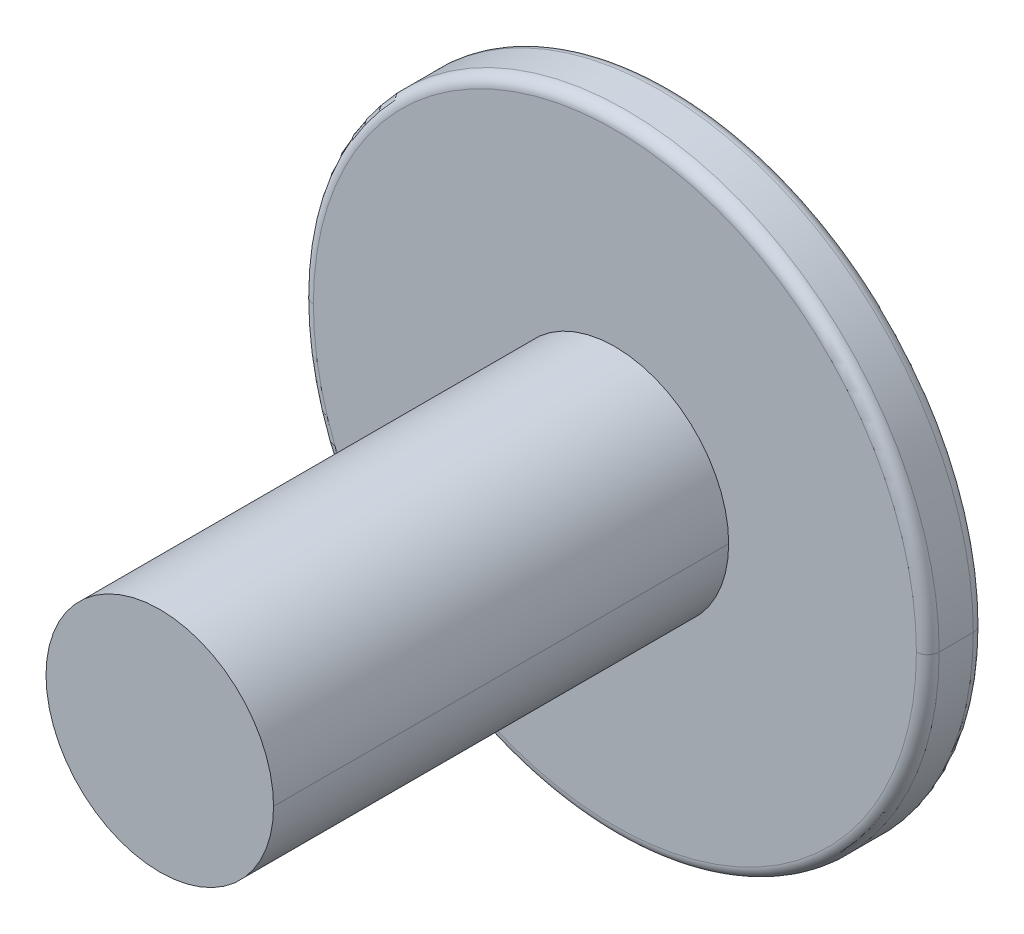
ISO-10303-21;
HEADER;
FILE_DESCRIPTION(('STEP AP214'),'2;1');
FILE_NAME('part.step','',(''),(''),'','','');
FILE_SCHEMA(('AUTOMOTIVE_DESIGN { 1 0 10303 214 1 1 1 1 }'));
ENDSEC;
DATA;
#1=APPLICATION_CONTEXT('core data for automotive mechanical design processes');
#2=APPLICATION_PROTOCOL_DEFINITION('international standard','automotive_design',2000,#1);
#3=PRODUCT_CONTEXT('',#1,'mechanical');
#4=PRODUCT('Part','Part','',(#3));
#5=PRODUCT_RELATED_PRODUCT_CATEGORY('part','',(#4));
#6=PRODUCT_DEFINITION_FORMATION('','',#4);
#7=PRODUCT_DEFINITION_CONTEXT('part definition',#1,'design');
#8=PRODUCT_DEFINITION('design','',#6,#7);
#9=PRODUCT_DEFINITION_SHAPE('','',#8);
#10=(LENGTH_UNIT() NAMED_UNIT(*) SI_UNIT(.MILLI.,.METRE.));
#11=(NAMED_UNIT(*) PLANE_ANGLE_UNIT() SI_UNIT($,.RADIAN.));
#12=(NAMED_UNIT(*) SI_UNIT($,.STERADIAN.) SOLID_ANGLE_UNIT());
#13=UNCERTAINTY_MEASURE_WITH_UNIT(LENGTH_MEASURE(1.E-05),#10,'distance_accuracy_value','');
#14=(GEOMETRIC_REPRESENTATION_CONTEXT(3) GLOBAL_UNCERTAINTY_ASSIGNED_CONTEXT((#13)) GLOBAL_UNIT_ASSIGNED_CONTEXT((#10,
#11,#12)) REPRESENTATION_CONTEXT('',''));
#15=CARTESIAN_POINT('',(0.,0.,0.));
#16=DIRECTION('',(0.,0.,1.));
#17=DIRECTION('',(1.,0.,0.));
#18=AXIS2_PLACEMENT_3D('',#15,#16,#17);
#19=CARTESIAN_POINT('',(0.,0.,4.5));
#20=DIRECTION('',(0.,0.,1.));
#21=DIRECTION('',(1.,0.,0.));
#22=AXIS2_PLACEMENT_3D('',#19,#20,#21);
#23=PLANE('',#22);
#24=CARTESIAN_POINT('',(0.,0.,4.5));
#25=DIRECTION('',(0.,0.,-1.));
#26=DIRECTION('',(-1.,0.,0.));
#27=AXIS2_PLACEMENT_3D('',#24,#25,#26);
#28=CIRCLE('',#27,1.);
#29=CARTESIAN_POINT('',(-1.,0.,4.5));
#30=VERTEX_POINT('',#29);
#31=CARTESIAN_POINT('',(1.,0.,4.5));
#32=VERTEX_POINT('',#31);
#33=EDGE_CURVE('E11',#30,#32,#28,.T.);
#34=ORIENTED_EDGE('',*,*,#33,.F.);
#35=CARTESIAN_POINT('',(0.,0.,4.5));
#36=DIRECTION('',(0.,0.,-1.));
#37=DIRECTION('',(1.,0.,0.));
#38=AXIS2_PLACEMENT_3D('',#35,#36,#37);
#39=CIRCLE('',#38,1.);
#40=EDGE_CURVE('E454',#32,#30,#39,.T.);
#41=ORIENTED_EDGE('',*,*,#40,.F.);
#42=EDGE_LOOP('',(#34,#41));
#43=FACE_BOUND('',#42,.T.);
#44=ADVANCED_FACE('F16',(#43),#23,.T.);
#45=CARTESIAN_POINT('',(0.,0.,4.5));
#46=DIRECTION('',(0.,0.,-1.));
#47=DIRECTION('',(-1.,0.,0.));
#48=AXIS2_PLACEMENT_3D('',#45,#46,#47);
#49=CYLINDRICAL_SURFACE('',#48,1.);
#50=DIRECTION('',(0.,0.,-1.));
#51=VECTOR('',#50,1.);
#52=CARTESIAN_POINT('',(1.,0.,4.5));
#53=LINE('',#52,#51);
#54=CARTESIAN_POINT('',(1.,0.,0.5));
#55=VERTEX_POINT('',#54);
#56=EDGE_CURVE('E29',#32,#55,#53,.T.);
#57=ORIENTED_EDGE('',*,*,#56,.T.);
#58=CARTESIAN_POINT('',(0.,0.,0.5));
#59=DIRECTION('',(0.,0.,1.));
#60=DIRECTION('',(1.,0.,0.));
#61=AXIS2_PLACEMENT_3D('',#58,#59,#60);
#62=CIRCLE('',#61,1.);
#63=CARTESIAN_POINT('',(-1.,0.,0.5));
#64=VERTEX_POINT('',#63);
#65=EDGE_CURVE('E515',#55,#64,#62,.T.);
#66=ORIENTED_EDGE('',*,*,#65,.T.);
#67=DIRECTION('',(0.,0.,-1.));
#68=VECTOR('',#67,1.);
#69=CARTESIAN_POINT('',(-1.,0.,4.5));
#70=LINE('',#69,#68);
#71=EDGE_CURVE('E520',#30,#64,#70,.T.);
#72=ORIENTED_EDGE('',*,*,#71,.F.);
#73=ORIENTED_EDGE('',*,*,#33,.T.);
#74=EDGE_LOOP('',(#57,#66,#72,#73));
#75=FACE_BOUND('',#74,.T.);
#76=ADVANCED_FACE('F378',(#75),#49,.T.);
#77=CARTESIAN_POINT('',(0.,0.,4.5));
#78=DIRECTION('',(0.,0.,-1.));
#79=DIRECTION('',(-1.,0.,0.));
#80=AXIS2_PLACEMENT_3D('',#77,#78,#79);
#81=CYLINDRICAL_SURFACE('',#80,1.);
#82=ORIENTED_EDGE('',*,*,#40,.T.);
#83=ORIENTED_EDGE('',*,*,#71,.T.);
#84=CARTESIAN_POINT('',(0.,0.,0.5));
#85=DIRECTION('',(0.,0.,1.));
#86=DIRECTION('',(-1.,0.,0.));
#87=AXIS2_PLACEMENT_3D('',#84,#85,#86);
#88=CIRCLE('',#87,1.);
#89=EDGE_CURVE('E519',#64,#55,#88,.T.);
#90=ORIENTED_EDGE('',*,*,#89,.T.);
#91=ORIENTED_EDGE('',*,*,#56,.F.);
#92=EDGE_LOOP('',(#82,#83,#90,#91));
#93=FACE_BOUND('',#92,.T.);
#94=ADVANCED_FACE('F748',(#93),#81,.T.);
#95=CARTESIAN_POINT('',(0.,0.,0.4));
#96=DIRECTION('',(0.,0.,1.));
#97=DIRECTION('',(1.,0.,0.));
#98=AXIS2_PLACEMENT_3D('',#95,#96,#97);
#99=TOROIDAL_SURFACE('',#98,2.65,0.1);
#100=CARTESIAN_POINT('',(0.,0.,0.4));
#101=DIRECTION('',(0.,0.,-1.));
#102=DIRECTION('',(1.,0.,0.));
#103=AXIS2_PLACEMENT_3D('',#100,#101,#102);
#104=CIRCLE('',#103,2.75);
#105=CARTESIAN_POINT('',(2.75,0.,0.4));
#106=VERTEX_POINT('',#105);
#107=CARTESIAN_POINT('',(-2.75,0.,0.4));
#108=VERTEX_POINT('',#107);
#109=EDGE_CURVE('E1241',#106,#108,#104,.T.);
#110=ORIENTED_EDGE('',*,*,#109,.F.);
#111=CARTESIAN_POINT('',(2.65,0.,0.4));
#112=DIRECTION('',(0.,-1.,0.));
#113=DIRECTION('',(1.,0.,0.));
#114=AXIS2_PLACEMENT_3D('',#111,#112,#113);
#115=CIRCLE('',#114,0.1);
#116=CARTESIAN_POINT('',(2.65,0.,0.5));
#117=VERTEX_POINT('',#116);
#118=EDGE_CURVE('E469',#106,#117,#115,.T.);
#119=ORIENTED_EDGE('',*,*,#118,.T.);
#120=CARTESIAN_POINT('',(0.,0.,0.5));
#121=DIRECTION('',(0.,0.,-1.));
#122=DIRECTION('',(1.,0.,0.));
#123=AXIS2_PLACEMENT_3D('',#120,#121,#122);
#124=CIRCLE('',#123,2.65);
#125=CARTESIAN_POINT('',(-2.65,0.,0.5));
#126=VERTEX_POINT('',#125);
#127=EDGE_CURVE('E470',#117,#126,#124,.T.);
#128=ORIENTED_EDGE('',*,*,#127,.T.);
#129=CARTESIAN_POINT('',(-2.65,0.,0.4));
#130=DIRECTION('',(0.,1.,0.));
#131=DIRECTION('',(-1.,0.,0.));
#132=AXIS2_PLACEMENT_3D('',#129,#130,#131);
#133=CIRCLE('',#132,0.1);
#134=EDGE_CURVE('E529',#108,#126,#133,.T.);
#135=ORIENTED_EDGE('',*,*,#134,.F.);
#136=EDGE_LOOP('',(#110,#119,#128,#135));
#137=FACE_BOUND('',#136,.T.);
#138=ADVANCED_FACE('F743',(#137),#99,.T.);
#139=CARTESIAN_POINT('',(1.025578394524,-0.1931740126673,-1.));
#140=DIRECTION('',(0.,-0.981627183447674,0.190808995376495));
#141=DIRECTION('',(-1.,0.,0.));
#142=AXIS2_PLACEMENT_3D('',#139,#140,#141);
#143=PLANE('',#142);
#144=DIRECTION('',(-1.,-9.308210153282E-09,0.));
#145=VECTOR('',#144,1.);
#146=CARTESIAN_POINT('',(0.8790232051424,-0.1931740062833,-1.));
#147=LINE('',#146,#145);
#148=CARTESIAN_POINT('',(0.8790232051424,-0.1931740062833,-1.));
#149=VERTEX_POINT('',#148);
#150=CARTESIAN_POINT('',(0.1931740126673,-0.1931740126673,-1.));
#151=VERTEX_POINT('',#150);
#152=EDGE_CURVE('E450',#149,#151,#147,.T.);
#153=ORIENTED_EDGE('',*,*,#152,.T.);
#154=DIRECTION('',(0.187427559991904,-0.187427559991904,-0.964231206459821));
#155=VECTOR('',#154,1.);
#156=CARTESIAN_POINT('',(0.,0.,-0.006205857351492));
#157=LINE('',#156,#155);
#158=CARTESIAN_POINT('',(0.,0.,-0.006205857351492));
#159=VERTEX_POINT('',#158);
#160=EDGE_CURVE('E288',#159,#151,#157,.T.);
#161=ORIENTED_EDGE('',*,*,#160,.F.);
#162=DIRECTION('',(-1.,0.,0.));
#163=VECTOR('',#162,1.);
#164=CARTESIAN_POINT('',(0.8324043818572,0.,-0.006205857351446));
#165=LINE('',#164,#163);
#166=CARTESIAN_POINT('',(0.8324043818572,0.,-0.006205857351446));
#167=VERTEX_POINT('',#166);
#168=EDGE_CURVE('E484',#167,#159,#165,.T.);
#169=ORIENTED_EDGE('',*,*,#168,.F.);
#170=DIRECTION('',(0.187427560074405,-0.187427558764205,-0.964231206682425));
#171=VECTOR('',#170,1.);
#172=CARTESIAN_POINT('',(0.8324043818572,0.,-0.006205857351446));
#173=LINE('',#172,#171);
#174=CARTESIAN_POINT('',(1.023151677917,-0.1907472947266,-0.9875156251272));
#175=VERTEX_POINT('',#174);
#176=EDGE_CURVE('E184',#167,#175,#173,.T.);
#177=ORIENTED_EDGE('',*,*,#176,.T.);
#178=CARTESIAN_POINT('',(1.023151677917,-0.1907472947266,-0.9875156251272));
#179=CARTESIAN_POINT('',(1.007274944629,-0.1912862098716,-0.9902881032007));
#180=CARTESIAN_POINT('',(0.9754280751451,-0.1921838571073,-0.9949060925108));
#181=CARTESIAN_POINT('',(0.9272803540647,-0.1929941013938,-0.9990744222959));
#182=CARTESIAN_POINT('',(0.8951301687386,-0.1931740062833,-1.));
#183=CARTESIAN_POINT('',(0.8790232051424,-0.1931740062833,-1.));
#184=(BOUNDED_CURVE() B_SPLINE_CURVE(3,(#178,#179,#180,#181,#182,#183),.UNSPECIFIED.,.F.,
.F.) B_SPLINE_CURVE_WITH_KNOTS((4,1,1,4),(0.,0.3333333333333,0.6666666666667,1.),
.UNSPECIFIED.) CURVE() GEOMETRIC_REPRESENTATION_ITEM() RATIONAL_B_SPLINE_CURVE((1.,1.,1.,1.,1.,1.)) REPRESENTATION_ITEM(''));
#185=EDGE_CURVE('E179',#175,#149,#184,.T.);
#186=ORIENTED_EDGE('',*,*,#185,.T.);
#187=EDGE_LOOP('',(#153,#161,#169,#177,#186));
#188=FACE_BOUND('',#187,.T.);
#189=ADVANCED_FACE('F571',(#188),#143,.F.);
#190=CARTESIAN_POINT('',(0.,0.,-1.));
#191=DIRECTION('',(0.,0.,-1.));
#192=DIRECTION('',(0.,-1.,0.));
#193=AXIS2_PLACEMENT_3D('',#190,#191,#192);
#194=PLANE('',#193);
#195=ORIENTED_EDGE('',*,*,#152,.F.);
#196=CARTESIAN_POINT('',(0.,0.,-1.));
#197=DIRECTION('',(0.,0.,1.));
#198=DIRECTION('',(0.214637791852591,-0.976693717758358,0.));
#199=AXIS2_PLACEMENT_3D('',#196,#197,#198);
#200=CIRCLE('',#199,0.9);
#201=CARTESIAN_POINT('',(0.1931740126673,-0.8790243459825,-1.));
#202=VERTEX_POINT('',#201);
#203=EDGE_CURVE('E225',#202,#149,#200,.T.);
#204=ORIENTED_EDGE('',*,*,#203,.F.);
#205=DIRECTION('',(2.35711230862E-09,-1.,0.));
#206=VECTOR('',#205,1.);
#207=CARTESIAN_POINT('',(0.1931740126673,-0.1931740126673,-1.));
#208=LINE('',#207,#206);
#209=EDGE_CURVE('E455',#151,#202,#208,.T.);
#210=ORIENTED_EDGE('',*,*,#209,.F.);
#211=EDGE_LOOP('',(#195,#204,#210));
#212=FACE_BOUND('',#211,.T.);
#213=ADVANCED_FACE('F266',(#212),#194,.T.);
#214=CARTESIAN_POINT('',(0.1931740126673,-0.1931740126673,-1.));
#215=DIRECTION('',(0.981627183447674,0.,0.190808995376495));
#216=DIRECTION('',(0.,-1.,0.));
#217=AXIS2_PLACEMENT_3D('',#214,#215,#216);
#218=PLANE('',#217);
#219=DIRECTION('',(0.187427564971895,-0.187427559504395,-0.964231205586571));
#220=VECTOR('',#219,1.);
#221=CARTESIAN_POINT('',(0.,-0.8324043818572,-0.006205857351446));
#222=LINE('',#221,#220);
#223=CARTESIAN_POINT('',(0.,-0.8324043818572,-0.006205857351446));
#224=VERTEX_POINT('',#223);
#225=CARTESIAN_POINT('',(0.1907473090267,-1.02315168532,-0.987515665078));
#226=VERTEX_POINT('',#225);
#227=EDGE_CURVE('E280',#224,#226,#222,.T.);
#228=ORIENTED_EDGE('',*,*,#227,.F.);
#229=DIRECTION('',(0.,1.,0.));
#230=VECTOR('',#229,1.);
#231=CARTESIAN_POINT('',(0.,-0.8324043818572,-0.006205857351446));
#232=LINE('',#231,#230);
#233=EDGE_CURVE('E305',#224,#159,#232,.T.);
#234=ORIENTED_EDGE('',*,*,#233,.T.);
#235=ORIENTED_EDGE('',*,*,#160,.T.);
#236=ORIENTED_EDGE('',*,*,#209,.T.);
#237=CARTESIAN_POINT('',(0.1931740142839,-0.8790246348509,-1.));
#238=CARTESIAN_POINT('',(0.1931740142839,-0.895129465077,-1.));
#239=CARTESIAN_POINT('',(0.1929940981981,-0.927280722173,-0.9990744205812));
#240=CARTESIAN_POINT('',(0.1921838496556,-0.9754280174418,-0.9949060643752));
#241=CARTESIAN_POINT('',(0.1912862235996,-1.007274969102,-0.990288140208));
#242=CARTESIAN_POINT('',(0.1907473090267,-1.02315168532,-0.987515665078));
#243=(BOUNDED_CURVE() B_SPLINE_CURVE(3,(#237,#238,#239,#240,#241,#242),.UNSPECIFIED.,.F.,
.F.) B_SPLINE_CURVE_WITH_KNOTS((4,1,1,4),(0.,0.3333333333333,0.6666666666667,1.),
.UNSPECIFIED.) CURVE() GEOMETRIC_REPRESENTATION_ITEM() RATIONAL_B_SPLINE_CURVE((1.,1.,1.,1.,1.,1.)) REPRESENTATION_ITEM(''));
#244=EDGE_CURVE('E292',#202,#226,#243,.T.);
#245=ORIENTED_EDGE('',*,*,#244,.T.);
#246=EDGE_LOOP('',(#228,#234,#235,#236,#245));
#247=FACE_BOUND('',#246,.T.);
#248=ADVANCED_FACE('F257',(#247),#218,.F.);
#249=CARTESIAN_POINT('',(0.1931740126673,-1.025578394524,-1.));
#250=DIRECTION('',(0.,-0.981627183447674,0.190808995376495));
#251=DIRECTION('',(-1.,0.,0.));
#252=AXIS2_PLACEMENT_3D('',#249,#250,#251);
#253=PLANE('',#252);
#254=DIRECTION('',(-0.187427558729307,-0.187427560115408,-0.964231206681238));
#255=VECTOR('',#254,1.);
#256=CARTESIAN_POINT('',(0.,-0.8324043818572,-0.006205857351446));
#257=LINE('',#256,#255);
#258=CARTESIAN_POINT('',(-0.1907472946485,-1.023151677916,-0.9875156249064));
#259=VERTEX_POINT('',#258);
#260=EDGE_CURVE('E289',#224,#259,#257,.T.);
#261=ORIENTED_EDGE('',*,*,#260,.F.);
#262=ORIENTED_EDGE('',*,*,#227,.T.);
#263=CARTESIAN_POINT('',(0.1907473090267,-1.02315168563074,-0.987515665017598));
#264=CARTESIAN_POINT('',(6.51179237024261E-07,-1.02432632330745,-0.993558651994614));
#265=CARTESIAN_POINT('',(-0.1907472946485,-1.0231516778369,-0.987515624921775));
#266=B_SPLINE_CURVE_WITH_KNOTS('',2,(#263,#264,#265),.UNSPECIFIED.,.F.,.F.,(3,3),(0.,1.),.UNSPECIFIED.);
#267=EDGE_CURVE('E239',#226,#259,#266,.T.);
#268=ORIENTED_EDGE('',*,*,#267,.T.);
#269=EDGE_LOOP('',(#261,#262,#268));
#270=FACE_BOUND('',#269,.T.);
#271=ADVANCED_FACE('F246',(#270),#253,.F.);
#272=CARTESIAN_POINT('',(-0.1931740126673,-0.1931740126673,-1.));
#273=DIRECTION('',(-0.981627183447674,0.,0.190808995376495));
#274=DIRECTION('',(0.,1.,0.));
#275=AXIS2_PLACEMENT_3D('',#272,#273,#274);
#276=PLANE('',#275);
#277=DIRECTION('',(-9.246083379796E-09,1.,0.));
#278=VECTOR('',#277,1.);
#279=CARTESIAN_POINT('',(-0.1931740063259,-0.8790232127573,-1.));
#280=LINE('',#279,#278);
#281=CARTESIAN_POINT('',(-0.1931740063259,-0.8790232127573,-1.));
#282=VERTEX_POINT('',#281);
#283=CARTESIAN_POINT('',(-0.1931740126673,-0.1931740126673,-1.));
#284=VERTEX_POINT('',#283);
#285=EDGE_CURVE('E448',#282,#284,#280,.T.);
#286=ORIENTED_EDGE('',*,*,#285,.T.);
#287=DIRECTION('',(-0.187427559991904,-0.187427559991904,-0.964231206459821));
#288=VECTOR('',#287,1.);
#289=CARTESIAN_POINT('',(0.,0.,-0.006205857351492));
#290=LINE('',#289,#288);
#291=EDGE_CURVE('E449',#159,#284,#290,.T.);
#292=ORIENTED_EDGE('',*,*,#291,.F.);
#293=ORIENTED_EDGE('',*,*,#233,.F.);
#294=ORIENTED_EDGE('',*,*,#260,.T.);
#295=CARTESIAN_POINT('',(-0.1907472946485,-1.023151677916,-0.9875156249064));
#296=CARTESIAN_POINT('',(-0.1912862097935,-1.007274944639,-0.9902881029801));
#297=CARTESIAN_POINT('',(-0.192183857146,-0.9754280746468,-0.9949060925964));
#298=CARTESIAN_POINT('',(-0.1929941013666,-0.9272803558642,-0.9990744222823));
#299=CARTESIAN_POINT('',(-0.1931740063259,-0.8951301649238,-1.));
#300=CARTESIAN_POINT('',(-0.1931740063259,-0.8790232127573,-1.));
#301=(BOUNDED_CURVE() B_SPLINE_CURVE(3,(#295,#296,#297,#298,#299,#300),.UNSPECIFIED.,.F.,
.F.) B_SPLINE_CURVE_WITH_KNOTS((4,1,1,4),(0.,0.3333333333333,0.6666666666667,1.),
.UNSPECIFIED.) CURVE() GEOMETRIC_REPRESENTATION_ITEM() RATIONAL_B_SPLINE_CURVE((1.,1.,1.,1.,1.,1.)) REPRESENTATION_ITEM(''));
#302=EDGE_CURVE('E308',#259,#282,#301,.T.);
#303=ORIENTED_EDGE('',*,*,#302,.T.);
#304=EDGE_LOOP('',(#286,#292,#293,#294,#303));
#305=FACE_BOUND('',#304,.T.);
#306=ADVANCED_FACE('F256',(#305),#276,.F.);
#307=CARTESIAN_POINT('',(0.,0.,-1.));
#308=DIRECTION('',(0.,0.,-1.));
#309=DIRECTION('',(0.,-1.,0.));
#310=AXIS2_PLACEMENT_3D('',#307,#308,#309);
#311=PLANE('',#310);
#312=CARTESIAN_POINT('',(0.,0.,-1.));
#313=DIRECTION('',(0.,0.,1.));
#314=DIRECTION('',(-0.976693717758358,-0.214637791852591,0.));
#315=AXIS2_PLACEMENT_3D('',#312,#313,#314);
#316=CIRCLE('',#315,0.9);
#317=CARTESIAN_POINT('',(-0.8790243459825,-0.1931740126673,-1.));
#318=VERTEX_POINT('',#317);
#319=EDGE_CURVE('E312',#318,#282,#316,.T.);
#320=ORIENTED_EDGE('',*,*,#319,.F.);
#321=DIRECTION('',(-1.,-2.356972205573E-09,0.));
#322=VECTOR('',#321,1.);
#323=CARTESIAN_POINT('',(-0.1931740126673,-0.1931740126673,-1.));
#324=LINE('',#323,#322);
#325=EDGE_CURVE('E445',#284,#318,#324,.T.);
#326=ORIENTED_EDGE('',*,*,#325,.F.);
#327=ORIENTED_EDGE('',*,*,#285,.F.);
#328=EDGE_LOOP('',(#320,#326,#327));
#329=FACE_BOUND('',#328,.T.);
#330=ADVANCED_FACE('F668',(#329),#311,.T.);
#331=CARTESIAN_POINT('',(-0.1931740126673,-0.1931740126673,-1.));
#332=DIRECTION('',(0.,-0.981627183447674,0.190808995376495));
#333=DIRECTION('',(-1.,0.,0.));
#334=AXIS2_PLACEMENT_3D('',#331,#332,#333);
#335=PLANE('',#334);
#336=DIRECTION('',(-0.187427559657298,-0.187427564965499,-0.964231205558093));
#337=VECTOR('',#336,1.);
#338=CARTESIAN_POINT('',(-0.8324043818572,0.,-0.006205857351446));
#339=LINE('',#338,#337);
#340=CARTESIAN_POINT('',(-0.8324043818572,0.,-0.006205857351446));
#341=VERTEX_POINT('',#340);
#342=CARTESIAN_POINT('',(-1.023151685475,-0.1907473090205,-0.9875156650503));
#343=VERTEX_POINT('',#342);
#344=EDGE_CURVE('E512',#341,#343,#339,.T.);
#345=ORIENTED_EDGE('',*,*,#344,.F.);
#346=DIRECTION('',(1.,0.,0.));
#347=VECTOR('',#346,1.);
#348=CARTESIAN_POINT('',(-0.8324043818572,0.,-0.006205857351446));
#349=LINE('',#348,#347);
#350=EDGE_CURVE('E490',#341,#159,#349,.T.);
#351=ORIENTED_EDGE('',*,*,#350,.T.);
#352=ORIENTED_EDGE('',*,*,#291,.T.);
#353=ORIENTED_EDGE('',*,*,#325,.T.);
#354=CARTESIAN_POINT('',(-0.8790246348337,-0.1931740142838,-1.));
#355=CARTESIAN_POINT('',(-0.8951294650856,-0.1931740142838,-1.));
#356=CARTESIAN_POINT('',(-0.92728072219,-0.1929940981975,-0.9990744205787));
#357=CARTESIAN_POINT('',(-0.9754280173694,-0.1921838496577,-0.9949060643838));
#358=CARTESIAN_POINT('',(-1.007274969259,-0.191286223595,-0.9902881401893));
#359=CARTESIAN_POINT('',(-1.023151685475,-0.1907473090205,-0.9875156650503));
#360=(BOUNDED_CURVE() B_SPLINE_CURVE(3,(#354,#355,#356,#357,#358,#359),.UNSPECIFIED.,.F.,
.F.) B_SPLINE_CURVE_WITH_KNOTS((4,1,1,4),(0.,0.3333333333333,0.6666666666667,1.),
.UNSPECIFIED.) CURVE() GEOMETRIC_REPRESENTATION_ITEM() RATIONAL_B_SPLINE_CURVE((1.,1.,1.,1.,1.,1.)) REPRESENTATION_ITEM(''));
#361=EDGE_CURVE('E478',#318,#343,#360,.T.);
#362=ORIENTED_EDGE('',*,*,#361,.T.);
#363=EDGE_LOOP('',(#345,#351,#352,#353,#362));
#364=FACE_BOUND('',#363,.T.);
#365=ADVANCED_FACE('F342',(#364),#335,.F.);
#366=CARTESIAN_POINT('',(-1.025578394524,0.1931740126673,-1.));
#367=DIRECTION('',(-0.981627183447674,0.,0.190808995376495));
#368=DIRECTION('',(0.,1.,0.));
#369=AXIS2_PLACEMENT_3D('',#366,#367,#368);
#370=PLANE('',#369);
#371=CARTESIAN_POINT('',(-1.02370793964649,0.,-0.990377343848199));
#372=DIRECTION('',(0.00291588331628573,0.999883228205621,0.0150009192249037));
#373=VECTOR('',#372,1.);
#374=LINE('',#371,#373);
#375=CARTESIAN_POINT('',(-1.023707939647,0.,-0.990377343848));
#376=VERTEX_POINT('',#375);
#377=CARTESIAN_POINT('',(-1.023151677877,0.1907472946499,-0.9875156249129));
#378=VERTEX_POINT('',#377);
#379=EDGE_CURVE('E361',#376,#378,#374,.T.);
#380=ORIENTED_EDGE('',*,*,#379,.T.);
#381=DIRECTION('',(-0.187427560076595,0.187427558730895,-0.964231206688474));
#382=VECTOR('',#381,1.);
#383=CARTESIAN_POINT('',(-0.8324043818572,0.,-0.006205857351446));
#384=LINE('',#383,#382);
#385=EDGE_CURVE('E366',#341,#378,#384,.T.);
#386=ORIENTED_EDGE('',*,*,#385,.F.);
#387=ORIENTED_EDGE('',*,*,#344,.T.);
#388=CARTESIAN_POINT('',(-1.0231516856312,-0.1907473090205,-0.987515665019938));
#389=DIRECTION('',(-0.00291584224803148,0.999883231495094,-0.0150007079470538));
#390=VECTOR('',#389,1.);
#391=LINE('',#388,#390);
#392=EDGE_CURVE('E325',#343,#376,#391,.T.);
#393=ORIENTED_EDGE('',*,*,#392,.T.);
#394=EDGE_LOOP('',(#380,#386,#387,#393));
#395=FACE_BOUND('',#394,.T.);
#396=ADVANCED_FACE('F331',(#395),#370,.F.);
#397=CARTESIAN_POINT('',(-0.1931740126673,0.1931740126673,-1.));
#398=DIRECTION('',(0.,0.981627183447674,0.190808995376495));
#399=DIRECTION('',(1.,0.,0.));
#400=AXIS2_PLACEMENT_3D('',#397,#398,#399);
#401=PLANE('',#400);
#402=DIRECTION('',(1.,9.24622008403E-09,0.));
#403=VECTOR('',#402,1.);
#404=CARTESIAN_POINT('',(-0.8790232127406,0.1931740063258,-1.));
#405=LINE('',#404,#403);
#406=CARTESIAN_POINT('',(-0.8790232127406,0.1931740063258,-1.));
#407=VERTEX_POINT('',#406);
#408=CARTESIAN_POINT('',(-0.1931740126673,0.1931740126673,-1.));
#409=VERTEX_POINT('',#408);
#410=EDGE_CURVE('E488',#407,#409,#405,.T.);
#411=ORIENTED_EDGE('',*,*,#410,.T.);
#412=DIRECTION('',(-0.187427559991904,0.187427559991904,-0.964231206459821));
#413=VECTOR('',#412,1.);
#414=CARTESIAN_POINT('',(0.,0.,-0.006205857351492));
#415=LINE('',#414,#413);
#416=EDGE_CURVE('E397',#159,#409,#415,.T.);
#417=ORIENTED_EDGE('',*,*,#416,.F.);
#418=ORIENTED_EDGE('',*,*,#350,.F.);
#419=ORIENTED_EDGE('',*,*,#385,.T.);
#420=CARTESIAN_POINT('',(-1.023151677877,0.1907472946499,-0.9875156249129));
#421=CARTESIAN_POINT('',(-1.007274944599,0.1912862097945,-0.9902881029842));
#422=CARTESIAN_POINT('',(-0.9754280746666,0.1921838571456,-0.9949060925944));
#423=CARTESIAN_POINT('',(-0.927280355855,0.1929941013667,-0.9990744222828));
#424=CARTESIAN_POINT('',(-0.8951301649322,0.1931740063258,-1.));
#425=CARTESIAN_POINT('',(-0.8790232127406,0.1931740063258,-1.));
#426=(BOUNDED_CURVE() B_SPLINE_CURVE(3,(#420,#421,#422,#423,#424,#425),.UNSPECIFIED.,.F.,
.F.) B_SPLINE_CURVE_WITH_KNOTS((4,1,1,4),(0.,0.3333333333333,0.6666666666667,1.),
.UNSPECIFIED.) CURVE() GEOMETRIC_REPRESENTATION_ITEM() RATIONAL_B_SPLINE_CURVE((1.,1.,1.,1.,1.,1.)) REPRESENTATION_ITEM(''));
#427=EDGE_CURVE('E630',#378,#407,#426,.T.);
#428=ORIENTED_EDGE('',*,*,#427,.T.);
#429=EDGE_LOOP('',(#411,#417,#418,#419,#428));
#430=FACE_BOUND('',#429,.T.);
#431=ADVANCED_FACE('F341',(#430),#401,.F.);
#432=CARTESIAN_POINT('',(0.,0.,-1.));
#433=DIRECTION('',(0.,0.,-1.));
#434=DIRECTION('',(0.,-1.,0.));
#435=AXIS2_PLACEMENT_3D('',#432,#433,#434);
#436=PLANE('',#435);
#437=ORIENTED_EDGE('',*,*,#410,.F.);
#438=CARTESIAN_POINT('',(0.,0.,-1.));
#439=DIRECTION('',(0.,0.,1.));
#440=DIRECTION('',(-0.214637791852591,0.976693717758358,0.));
#441=AXIS2_PLACEMENT_3D('',#438,#439,#440);
#442=CIRCLE('',#441,0.9);
#443=CARTESIAN_POINT('',(-0.1931740126673,0.8790243459825,-1.));
#444=VERTEX_POINT('',#443);
#445=EDGE_CURVE('E405',#444,#407,#442,.T.);
#446=ORIENTED_EDGE('',*,*,#445,.F.);
#447=DIRECTION('',(-2.294991660756E-09,1.,0.));
#448=VECTOR('',#447,1.);
#449=CARTESIAN_POINT('',(-0.1931740126673,0.1931740126673,-1.));
#450=LINE('',#449,#448);
#451=EDGE_CURVE('E491',#409,#444,#450,.T.);
#452=ORIENTED_EDGE('',*,*,#451,.F.);
#453=EDGE_LOOP('',(#437,#446,#452));
#454=FACE_BOUND('',#453,.T.);
#455=ADVANCED_FACE('F656',(#454),#436,.T.);
#456=CARTESIAN_POINT('',(-0.1931740126673,1.025578394524,-1.));
#457=DIRECTION('',(-0.981627183447674,0.,0.190808995376495));
#458=DIRECTION('',(0.,1.,0.));
#459=AXIS2_PLACEMENT_3D('',#456,#457,#458);
#460=PLANE('',#459);
#461=DIRECTION('',(-0.187427565005303,0.187427559501104,-0.964231205580717));
#462=VECTOR('',#461,1.);
#463=CARTESIAN_POINT('',(0.,0.8324043818572,-0.006205857351446));
#464=LINE('',#463,#462);
#465=CARTESIAN_POINT('',(0.,0.8324043818572,-0.006205857351446));
#466=VERTEX_POINT('',#465);
#467=CARTESIAN_POINT('',(-0.1907473091037,1.023151685359,-0.987515665293));
#468=VERTEX_POINT('',#467);
#469=EDGE_CURVE('E389',#466,#468,#464,.T.);
#470=ORIENTED_EDGE('',*,*,#469,.F.);
#471=DIRECTION('',(0.,-1.,0.));
#472=VECTOR('',#471,1.);
#473=CARTESIAN_POINT('',(0.,0.8324043818572,-0.006205857351446));
#474=LINE('',#473,#472);
#475=EDGE_CURVE('E416',#466,#159,#474,.T.);
#476=ORIENTED_EDGE('',*,*,#475,.T.);
#477=ORIENTED_EDGE('',*,*,#416,.T.);
#478=ORIENTED_EDGE('',*,*,#451,.T.);
#479=CARTESIAN_POINT('',(-0.1931740142413,0.879024627238,-1.));
#480=CARTESIAN_POINT('',(-0.1931740142413,0.8951294688908,-1.));
#481=CARTESIAN_POINT('',(-0.1929940982252,0.9272807203791,-0.9990744205944));
#482=CARTESIAN_POINT('',(-0.1921838496172,0.9754280179217,-0.9949060642913));
#483=CARTESIAN_POINT('',(-0.1912862236769,1.007274969131,-0.990288140425));
#484=CARTESIAN_POINT('',(-0.1907473091037,1.023151685359,-0.987515665293));
#485=(BOUNDED_CURVE() B_SPLINE_CURVE(3,(#479,#480,#481,#482,#483,#484),.UNSPECIFIED.,.F.,
.F.) B_SPLINE_CURVE_WITH_KNOTS((4,1,1,4),(0.,0.3333333333333,0.6666666666667,1.),
.UNSPECIFIED.) CURVE() GEOMETRIC_REPRESENTATION_ITEM() RATIONAL_B_SPLINE_CURVE((1.,1.,1.,1.,1.,1.)) REPRESENTATION_ITEM(''));
#486=EDGE_CURVE('E401',#444,#468,#485,.T.);
#487=ORIENTED_EDGE('',*,*,#486,.T.);
#488=EDGE_LOOP('',(#470,#476,#477,#478,#487));
#489=FACE_BOUND('',#488,.T.);
#490=ADVANCED_FACE('F867',(#489),#460,.F.);
#491=CARTESIAN_POINT('',(0.1931740126673,1.025578394524,-1.));
#492=DIRECTION('',(0.,0.981627183447674,0.190808995376495));
#493=DIRECTION('',(1.,0.,0.));
#494=AXIS2_PLACEMENT_3D('',#491,#492,#493);
#495=PLANE('',#494);
#496=DIRECTION('',(0.187427558762695,0.187427560112195,-0.964231206675373));
#497=VECTOR('',#496,1.);
#498=CARTESIAN_POINT('',(0.,0.8324043818572,-0.006205857351446));
#499=LINE('',#498,#497);
#500=CARTESIAN_POINT('',(0.1907472947253,1.023151677956,-0.987515625121));
#501=VERTEX_POINT('',#500);
#502=EDGE_CURVE('E398',#466,#501,#499,.T.);
#503=ORIENTED_EDGE('',*,*,#502,.F.);
#504=ORIENTED_EDGE('',*,*,#469,.T.);
#505=CARTESIAN_POINT('',(-0.1907473091037,1.02315168567243,-0.987515665232075));
#506=CARTESIAN_POINT('',(-6.51195779482854E-07,1.02432632335035,-0.993558652215319));
#507=CARTESIAN_POINT('',(0.1907472947253,1.02315167787856,-0.987515625136054));
#508=B_SPLINE_CURVE_WITH_KNOTS('',2,(#505,#506,#507),.UNSPECIFIED.,.F.,.F.,(3,3),(0.,1.),.UNSPECIFIED.);
#509=EDGE_CURVE('E406',#468,#501,#508,.T.);
#510=ORIENTED_EDGE('',*,*,#509,.T.);
#511=EDGE_LOOP('',(#503,#504,#510));
#512=FACE_BOUND('',#511,.T.);
#513=ADVANCED_FACE('F271',(#512),#495,.F.);
#514=CARTESIAN_POINT('',(0.1931740126673,1.025578394524,-1.));
#515=DIRECTION('',(0.981627183447674,0.,0.190808995376495));
#516=DIRECTION('',(0.,-1.,0.));
#517=AXIS2_PLACEMENT_3D('',#514,#515,#516);
#518=PLANE('',#517);
#519=DIRECTION('',(9.308071870755E-09,-1.,0.));
#520=VECTOR('',#519,1.);
#521=CARTESIAN_POINT('',(0.1931740062834,0.8790232051593,-1.));
#522=LINE('',#521,#520);
#523=CARTESIAN_POINT('',(0.1931740062834,0.8790232051593,-1.));
#524=VERTEX_POINT('',#523);
#525=CARTESIAN_POINT('',(0.1931740126673,0.1931740126673,-1.));
#526=VERTEX_POINT('',#525);
#527=EDGE_CURVE('E505',#524,#526,#522,.T.);
#528=ORIENTED_EDGE('',*,*,#527,.T.);
#529=DIRECTION('',(0.187427559991904,0.187427559991904,-0.964231206459821));
#530=VECTOR('',#529,1.);
#531=CARTESIAN_POINT('',(0.,0.,-0.006205857351492));
#532=LINE('',#531,#530);
#533=EDGE_CURVE('E479',#159,#526,#532,.T.);
#534=ORIENTED_EDGE('',*,*,#533,.F.);
#535=ORIENTED_EDGE('',*,*,#475,.F.);
#536=ORIENTED_EDGE('',*,*,#502,.T.);
#537=CARTESIAN_POINT('',(0.1907472947253,1.023151677956,-0.987515625121));
#538=CARTESIAN_POINT('',(0.1912862098707,1.007274944668,-0.9902881031966));
#539=CARTESIAN_POINT('',(0.1921838571077,0.9754280751258,-0.9949060925127));
#540=CARTESIAN_POINT('',(0.1929941013936,0.9272803540738,-0.9990744222955));
#541=CARTESIAN_POINT('',(0.1931740062834,0.8951301687301,-1.));
#542=CARTESIAN_POINT('',(0.1931740062834,0.8790232051593,-1.));
#543=(BOUNDED_CURVE() B_SPLINE_CURVE(3,(#537,#538,#539,#540,#541,#542),.UNSPECIFIED.,.F.,
.F.) B_SPLINE_CURVE_WITH_KNOTS((4,1,1,4),(0.,0.3333333333333,0.6666666666667,1.),
.UNSPECIFIED.) CURVE() GEOMETRIC_REPRESENTATION_ITEM() RATIONAL_B_SPLINE_CURVE((1.,1.,1.,1.,1.,1.)) REPRESENTATION_ITEM(''));
#544=EDGE_CURVE('E419',#501,#524,#543,.T.);
#545=ORIENTED_EDGE('',*,*,#544,.T.);
#546=EDGE_LOOP('',(#528,#534,#535,#536,#545));
#547=FACE_BOUND('',#546,.T.);
#548=ADVANCED_FACE('F18',(#547),#518,.F.);
#549=CARTESIAN_POINT('',(0.,0.,-1.));
#550=DIRECTION('',(0.,0.,-1.));
#551=DIRECTION('',(0.,-1.,0.));
#552=AXIS2_PLACEMENT_3D('',#549,#550,#551);
#553=PLANE('',#552);
#554=ORIENTED_EDGE('',*,*,#527,.F.);
#555=CARTESIAN_POINT('',(0.,0.,-1.));
#556=DIRECTION('',(0.,0.,1.));
#557=DIRECTION('',(0.976693717758358,0.214637791852591,0.));
#558=AXIS2_PLACEMENT_3D('',#555,#556,#557);
#559=CIRCLE('',#558,0.9);
#560=CARTESIAN_POINT('',(0.8790243459825,0.1931740126673,-1.));
#561=VERTEX_POINT('',#560);
#562=EDGE_CURVE('E422',#561,#524,#559,.T.);
#563=ORIENTED_EDGE('',*,*,#562,.F.);
#564=DIRECTION('',(1.,2.294991417943E-09,0.));
#565=VECTOR('',#564,1.);
#566=CARTESIAN_POINT('',(0.1931740126673,0.1931740126673,-1.));
#567=LINE('',#566,#565);
#568=EDGE_CURVE('E483',#526,#561,#567,.T.);
#569=ORIENTED_EDGE('',*,*,#568,.F.);
#570=EDGE_LOOP('',(#554,#563,#569));
#571=FACE_BOUND('',#570,.T.);
#572=ADVANCED_FACE('F572',(#571),#553,.T.);
#573=CARTESIAN_POINT('',(1.025578394524,0.1931740126673,-1.));
#574=DIRECTION('',(0.,0.981627183447674,0.190808995376495));
#575=DIRECTION('',(1.,0.,0.));
#576=AXIS2_PLACEMENT_3D('',#573,#574,#575);
#577=PLANE('',#576);
#578=DIRECTION('',(0.187427559655105,0.187427564998905,-0.964231205552026));
#579=VECTOR('',#578,1.);
#580=CARTESIAN_POINT('',(0.8324043818572,0.,-0.006205857351446));
#581=LINE('',#580,#579);
#582=CARTESIAN_POINT('',(1.023151685516,0.1907473090975,-0.9875156652656));
#583=VERTEX_POINT('',#582);
#584=EDGE_CURVE('E192',#167,#583,#581,.T.);
#585=ORIENTED_EDGE('',*,*,#584,.F.);
#586=ORIENTED_EDGE('',*,*,#168,.T.);
#587=ORIENTED_EDGE('',*,*,#533,.T.);
#588=ORIENTED_EDGE('',*,*,#568,.T.);
#589=CARTESIAN_POINT('',(0.879024627238,0.1931740142413,-1.));
#590=CARTESIAN_POINT('',(0.8951294688908,0.1931740142413,-1.));
#591=CARTESIAN_POINT('',(0.9272807204002,0.1929940982247,-0.999074420592));
#592=CARTESIAN_POINT('',(0.9754280178477,0.1921838496193,-0.9949060642999));
#593=CARTESIAN_POINT('',(1.007274969289,0.1912862236725,-0.9902881404067));
#594=CARTESIAN_POINT('',(1.023151685516,0.1907473090975,-0.9875156652656));
#595=(BOUNDED_CURVE() B_SPLINE_CURVE(3,(#589,#590,#591,#592,#593,#594),.UNSPECIFIED.,.F.,
.F.) B_SPLINE_CURVE_WITH_KNOTS((4,1,1,4),(0.,0.3333333333333,0.6666666666667,1.),
.UNSPECIFIED.) CURVE() GEOMETRIC_REPRESENTATION_ITEM() RATIONAL_B_SPLINE_CURVE((1.,1.,1.,1.,1.,1.)) REPRESENTATION_ITEM(''));
#596=EDGE_CURVE('E198',#561,#583,#595,.T.);
#597=ORIENTED_EDGE('',*,*,#596,.T.);
#598=EDGE_LOOP('',(#585,#586,#587,#588,#597));
#599=FACE_BOUND('',#598,.T.);
#600=ADVANCED_FACE('F570',(#599),#577,.F.);
#601=CARTESIAN_POINT('',(1.025578394524,0.1931740126673,-1.));
#602=DIRECTION('',(0.981627183447674,0.,0.190808995376495));
#603=DIRECTION('',(0.,-1.,0.));
#604=AXIS2_PLACEMENT_3D('',#601,#602,#603);
#605=PLANE('',#604);
#606=CARTESIAN_POINT('',(1.02370793964649,0.,-0.990377343848199));
#607=DIRECTION('',(-0.00291588309712453,-0.999883228223175,0.0150009180974171));
#608=VECTOR('',#607,1.);
#609=LINE('',#606,#608);
#610=CARTESIAN_POINT('',(1.023707939647,0.,-0.9903773438481));
#611=VERTEX_POINT('',#610);
#612=EDGE_CURVE('E169',#611,#175,#609,.T.);
#613=ORIENTED_EDGE('',*,*,#612,.T.);
#614=ORIENTED_EDGE('',*,*,#176,.F.);
#615=ORIENTED_EDGE('',*,*,#584,.T.);
#616=CARTESIAN_POINT('',(1.02315168567302,0.1907473090975,-0.987515665235079));
#617=DIRECTION('',(0.00291584202769258,-0.999883231512743,-0.0150007068135098));
#618=VECTOR('',#617,1.);
#619=LINE('',#616,#618);
#620=EDGE_CURVE('E188',#583,#611,#619,.T.);
#621=ORIENTED_EDGE('',*,*,#620,.T.);
#622=EDGE_LOOP('',(#613,#614,#615,#621));
#623=FACE_BOUND('',#622,.T.);
#624=ADVANCED_FACE('F190',(#623),#605,.F.);
#625=CARTESIAN_POINT('',(0.,0.,-0.2));
#626=DIRECTION('',(0.,0.,-1.));
#627=DIRECTION('',(-1.,0.,0.));
#628=AXIS2_PLACEMENT_3D('',#625,#626,#627);
#629=TOROIDAL_SURFACE('',#628,0.9,0.8);
#630=CARTESIAN_POINT('',(0.,0.,-0.2));
#631=DIRECTION('',(0.,0.,1.));
#632=DIRECTION('',(-1.,0.,0.));
#633=AXIS2_PLACEMENT_3D('',#630,#631,#632);
#634=CIRCLE('',#633,1.7);
#635=CARTESIAN_POINT('',(-1.7,0.,-0.2));
#636=VERTEX_POINT('',#635);
#637=CARTESIAN_POINT('',(1.7,0.,-0.2));
#638=VERTEX_POINT('',#637);
#639=EDGE_CURVE('E487',#636,#638,#634,.T.);
#640=ORIENTED_EDGE('',*,*,#639,.F.);
#641=CARTESIAN_POINT('',(-0.9,0.,-0.2));
#642=DIRECTION('',(0.,-1.,0.));
#643=DIRECTION('',(-1.,0.,0.));
#644=AXIS2_PLACEMENT_3D('',#641,#642,#643);
#645=CIRCLE('',#644,0.8);
#646=EDGE_CURVE('E601',#636,#376,#645,.T.);
#647=ORIENTED_EDGE('',*,*,#646,.T.);
#648=ORIENTED_EDGE('',*,*,#392,.F.);
#649=ORIENTED_EDGE('',*,*,#361,.F.);
#650=ORIENTED_EDGE('',*,*,#319,.T.);
#651=ORIENTED_EDGE('',*,*,#302,.F.);
#652=ORIENTED_EDGE('',*,*,#267,.F.);
#653=ORIENTED_EDGE('',*,*,#244,.F.);
#654=ORIENTED_EDGE('',*,*,#203,.T.);
#655=ORIENTED_EDGE('',*,*,#185,.F.);
#656=ORIENTED_EDGE('',*,*,#612,.F.);
#657=CARTESIAN_POINT('',(0.9,0.,-0.2));
#658=DIRECTION('',(0.,1.,0.));
#659=DIRECTION('',(1.,0.,0.));
#660=AXIS2_PLACEMENT_3D('',#657,#658,#659);
#661=CIRCLE('',#660,0.8);
#662=EDGE_CURVE('E175',#638,#611,#661,.T.);
#663=ORIENTED_EDGE('',*,*,#662,.F.);
#664=EDGE_LOOP('',(#640,#647,#648,#649,#650,#651,#652,#653,#654,#655,#656,#663));
#665=FACE_BOUND('',#664,.T.);
#666=ADVANCED_FACE('F173',(#665),#629,.T.);
#667=CARTESIAN_POINT('',(0.,0.,-0.2));
#668=DIRECTION('',(0.,0.,-1.));
#669=DIRECTION('',(-1.,0.,0.));
#670=AXIS2_PLACEMENT_3D('',#667,#668,#669);
#671=TOROIDAL_SURFACE('',#670,0.9,0.8);
#672=ORIENTED_EDGE('',*,*,#662,.T.);
#673=ORIENTED_EDGE('',*,*,#620,.F.);
#674=ORIENTED_EDGE('',*,*,#596,.F.);
#675=ORIENTED_EDGE('',*,*,#562,.T.);
#676=ORIENTED_EDGE('',*,*,#544,.F.);
#677=ORIENTED_EDGE('',*,*,#509,.F.);
#678=ORIENTED_EDGE('',*,*,#486,.F.);
#679=ORIENTED_EDGE('',*,*,#445,.T.);
#680=ORIENTED_EDGE('',*,*,#427,.F.);
#681=ORIENTED_EDGE('',*,*,#379,.F.);
#682=ORIENTED_EDGE('',*,*,#646,.F.);
#683=CARTESIAN_POINT('',(0.,0.,-0.2));
#684=DIRECTION('',(0.,0.,1.));
#685=DIRECTION('',(1.,0.,0.));
#686=AXIS2_PLACEMENT_3D('',#683,#684,#685);
#687=CIRCLE('',#686,1.7);
#688=EDGE_CURVE('E203',#638,#636,#687,.T.);
#689=ORIENTED_EDGE('',*,*,#688,.F.);
#690=EDGE_LOOP('',(#672,#673,#674,#675,#676,#677,#678,#679,#680,#681,#682,#689));
#691=FACE_BOUND('',#690,.T.);
#692=ADVANCED_FACE('F201',(#691),#671,.T.);
#693=CARTESIAN_POINT('',(0.,0.,-1.));
#694=DIRECTION('',(0.,0.,1.));
#695=DIRECTION('',(1.,0.,0.));
#696=AXIS2_PLACEMENT_3D('',#693,#694,#695);
#697=CYLINDRICAL_SURFACE('',#696,1.7);
#698=DIRECTION('',(0.,0.,1.));
#699=VECTOR('',#698,1.);
#700=CARTESIAN_POINT('',(-1.7,0.,-0.2));
#701=LINE('',#700,#699);
#702=CARTESIAN_POINT('',(-1.7,0.,0.));
#703=VERTEX_POINT('',#702);
#704=EDGE_CURVE('E211',#636,#703,#701,.T.);
#705=ORIENTED_EDGE('',*,*,#704,.T.);
#706=CARTESIAN_POINT('',(0.,0.,0.));
#707=DIRECTION('',(0.,0.,-1.));
#708=DIRECTION('',(-1.,0.,0.));
#709=AXIS2_PLACEMENT_3D('',#706,#707,#708);
#710=CIRCLE('',#709,1.7);
#711=CARTESIAN_POINT('',(1.7,0.,0.));
#712=VERTEX_POINT('',#711);
#713=EDGE_CURVE('E493',#703,#712,#710,.T.);
#714=ORIENTED_EDGE('',*,*,#713,.T.);
#715=DIRECTION('',(0.,0.,1.));
#716=VECTOR('',#715,1.);
#717=CARTESIAN_POINT('',(1.7,0.,-0.2));
#718=LINE('',#717,#716);
#719=EDGE_CURVE('E459',#638,#712,#718,.T.);
#720=ORIENTED_EDGE('',*,*,#719,.F.);
#721=ORIENTED_EDGE('',*,*,#688,.T.);
#722=EDGE_LOOP('',(#705,#714,#720,#721));
#723=FACE_BOUND('',#722,.T.);
#724=ADVANCED_FACE('F376',(#723),#697,.T.);
#725=CARTESIAN_POINT('',(0.,0.,-1.));
#726=DIRECTION('',(0.,0.,1.));
#727=DIRECTION('',(1.,0.,0.));
#728=AXIS2_PLACEMENT_3D('',#725,#726,#727);
#729=CYLINDRICAL_SURFACE('',#728,1.7);
#730=ORIENTED_EDGE('',*,*,#639,.T.);
#731=ORIENTED_EDGE('',*,*,#719,.T.);
#732=CARTESIAN_POINT('',(0.,0.,0.));
#733=DIRECTION('',(0.,0.,-1.));
#734=DIRECTION('',(1.,0.,0.));
#735=AXIS2_PLACEMENT_3D('',#732,#733,#734);
#736=CIRCLE('',#735,1.7);
#737=EDGE_CURVE('E497',#712,#703,#736,.T.);
#738=ORIENTED_EDGE('',*,*,#737,.T.);
#739=ORIENTED_EDGE('',*,*,#704,.F.);
#740=EDGE_LOOP('',(#730,#731,#738,#739));
#741=FACE_BOUND('',#740,.T.);
#742=ADVANCED_FACE('F781',(#741),#729,.T.);
#743=CARTESIAN_POINT('',(0.,0.,0.));
#744=DIRECTION('',(0.,0.,1.));
#745=DIRECTION('',(1.,0.,0.));
#746=AXIS2_PLACEMENT_3D('',#743,#744,#745);
#747=PLANE('',#746);
#748=ORIENTED_EDGE('',*,*,#713,.F.);
#749=ORIENTED_EDGE('',*,*,#737,.F.);
#750=EDGE_LOOP('',(#748,#749));
#751=FACE_BOUND('',#750,.T.);
#752=CARTESIAN_POINT('',(0.,0.,0.));
#753=DIRECTION('',(0.,0.,1.));
#754=DIRECTION('',(1.,0.,0.));
#755=AXIS2_PLACEMENT_3D('',#752,#753,#754);
#756=CIRCLE('',#755,2.65);
#757=CARTESIAN_POINT('',(2.65,0.,0.));
#758=VERTEX_POINT('',#757);
#759=CARTESIAN_POINT('',(-2.65,0.,0.));
#760=VERTEX_POINT('',#759);
#761=EDGE_CURVE('E498',#758,#760,#756,.T.);
#762=ORIENTED_EDGE('',*,*,#761,.F.);
#763=CARTESIAN_POINT('',(0.,0.,0.));
#764=DIRECTION('',(0.,0.,1.));
#765=DIRECTION('',(-1.,0.,0.));
#766=AXIS2_PLACEMENT_3D('',#763,#764,#765);
#767=CIRCLE('',#766,2.65);
#768=EDGE_CURVE('E1042',#760,#758,#767,.T.);
#769=ORIENTED_EDGE('',*,*,#768,.F.);
#770=EDGE_LOOP('',(#762,#769));
#771=FACE_BOUND('',#770,.T.);
#772=ADVANCED_FACE('F786',(#751,#771),#747,.F.);
#773=CARTESIAN_POINT('',(0.,0.,0.1));
#774=DIRECTION('',(0.,0.,1.));
#775=DIRECTION('',(1.,0.,0.));
#776=AXIS2_PLACEMENT_3D('',#773,#774,#775);
#777=TOROIDAL_SURFACE('',#776,2.65,0.1);
#778=CARTESIAN_POINT('',(-2.65,0.,0.1));
#779=DIRECTION('',(0.,1.,0.));
#780=DIRECTION('',(0.,0.,-1.));
#781=AXIS2_PLACEMENT_3D('',#778,#779,#780);
#782=CIRCLE('',#781,0.1);
#783=CARTESIAN_POINT('',(-2.75,0.,0.1));
#784=VERTEX_POINT('',#783);
#785=EDGE_CURVE('E1032',#760,#784,#782,.T.);
#786=ORIENTED_EDGE('',*,*,#785,.T.);
#787=CARTESIAN_POINT('',(0.,0.,0.1));
#788=DIRECTION('',(0.,0.,1.));
#789=DIRECTION('',(1.,0.,0.));
#790=AXIS2_PLACEMENT_3D('',#787,#788,#789);
#791=CIRCLE('',#790,2.75);
#792=CARTESIAN_POINT('',(2.75,0.,0.1));
#793=VERTEX_POINT('',#792);
#794=EDGE_CURVE('E464',#793,#784,#791,.T.);
#795=ORIENTED_EDGE('',*,*,#794,.F.);
#796=CARTESIAN_POINT('',(2.65,0.,0.1));
#797=DIRECTION('',(0.,-1.,0.));
#798=DIRECTION('',(0.,0.,-1.));
#799=AXIS2_PLACEMENT_3D('',#796,#797,#798);
#800=CIRCLE('',#799,0.1);
#801=EDGE_CURVE('E1033',#758,#793,#800,.T.);
#802=ORIENTED_EDGE('',*,*,#801,.F.);
#803=ORIENTED_EDGE('',*,*,#761,.T.);
#804=EDGE_LOOP('',(#786,#795,#802,#803));
#805=FACE_BOUND('',#804,.T.);
#806=ADVANCED_FACE('F258',(#805),#777,.T.);
#807=CARTESIAN_POINT('',(0.,0.,0.1));
#808=DIRECTION('',(0.,0.,1.));
#809=DIRECTION('',(1.,0.,0.));
#810=AXIS2_PLACEMENT_3D('',#807,#808,#809);
#811=TOROIDAL_SURFACE('',#810,2.65,0.1);
#812=ORIENTED_EDGE('',*,*,#768,.T.);
#813=ORIENTED_EDGE('',*,*,#801,.T.);
#814=CARTESIAN_POINT('',(0.,0.,0.1));
#815=DIRECTION('',(0.,0.,1.));
#816=DIRECTION('',(-1.,0.,0.));
#817=AXIS2_PLACEMENT_3D('',#814,#815,#816);
#818=CIRCLE('',#817,2.75);
#819=EDGE_CURVE('E443',#784,#793,#818,.T.);
#820=ORIENTED_EDGE('',*,*,#819,.F.);
#821=ORIENTED_EDGE('',*,*,#785,.F.);
#822=EDGE_LOOP('',(#812,#813,#820,#821));
#823=FACE_BOUND('',#822,.T.);
#824=ADVANCED_FACE('F260',(#823),#811,.T.);
#825=CARTESIAN_POINT('',(0.,0.,0.5));
#826=DIRECTION('',(0.,0.,-1.));
#827=DIRECTION('',(-1.,0.,0.));
#828=AXIS2_PLACEMENT_3D('',#825,#826,#827);
#829=CYLINDRICAL_SURFACE('',#828,2.75);
#830=ORIENTED_EDGE('',*,*,#109,.T.);
#831=DIRECTION('',(0.,0.,-1.));
#832=VECTOR('',#831,1.);
#833=CARTESIAN_POINT('',(-2.75,0.,0.4));
#834=LINE('',#833,#832);
#835=EDGE_CURVE('E543',#108,#784,#834,.T.);
#836=ORIENTED_EDGE('',*,*,#835,.T.);
#837=ORIENTED_EDGE('',*,*,#819,.T.);
#838=DIRECTION('',(0.,0.,-1.));
#839=VECTOR('',#838,1.);
#840=CARTESIAN_POINT('',(2.75,0.,0.4));
#841=LINE('',#840,#839);
#842=EDGE_CURVE('E460',#106,#793,#841,.T.);
#843=ORIENTED_EDGE('',*,*,#842,.F.);
#844=EDGE_LOOP('',(#830,#836,#837,#843));
#845=FACE_BOUND('',#844,.T.);
#846=ADVANCED_FACE('F263',(#845),#829,.T.);
#847=CARTESIAN_POINT('',(0.,0.,0.5));
#848=DIRECTION('',(0.,0.,-1.));
#849=DIRECTION('',(-1.,0.,0.));
#850=AXIS2_PLACEMENT_3D('',#847,#848,#849);
#851=CYLINDRICAL_SURFACE('',#850,2.75);
#852=ORIENTED_EDGE('',*,*,#842,.T.);
#853=ORIENTED_EDGE('',*,*,#794,.T.);
#854=ORIENTED_EDGE('',*,*,#835,.F.);
#855=CARTESIAN_POINT('',(0.,0.,0.4));
#856=DIRECTION('',(0.,0.,-1.));
#857=DIRECTION('',(-1.,0.,0.));
#858=AXIS2_PLACEMENT_3D('',#855,#856,#857);
#859=CIRCLE('',#858,2.75);
#860=EDGE_CURVE('E465',#108,#106,#859,.T.);
#861=ORIENTED_EDGE('',*,*,#860,.T.);
#862=EDGE_LOOP('',(#852,#853,#854,#861));
#863=FACE_BOUND('',#862,.T.);
#864=ADVANCED_FACE('F686',(#863),#851,.T.);
#865=CARTESIAN_POINT('',(0.,0.,0.4));
#866=DIRECTION('',(0.,0.,1.));
#867=DIRECTION('',(1.,0.,0.));
#868=AXIS2_PLACEMENT_3D('',#865,#866,#867);
#869=TOROIDAL_SURFACE('',#868,2.65,0.1);
#870=ORIENTED_EDGE('',*,*,#134,.T.);
#871=CARTESIAN_POINT('',(0.,0.,0.5));
#872=DIRECTION('',(0.,0.,-1.));
#873=DIRECTION('',(-1.,0.,0.));
#874=AXIS2_PLACEMENT_3D('',#871,#872,#873);
#875=CIRCLE('',#874,2.65);
#876=EDGE_CURVE('E474',#126,#117,#875,.T.);
#877=ORIENTED_EDGE('',*,*,#876,.T.);
#878=ORIENTED_EDGE('',*,*,#118,.F.);
#879=ORIENTED_EDGE('',*,*,#860,.F.);
#880=EDGE_LOOP('',(#870,#877,#878,#879));
#881=FACE_BOUND('',#880,.T.);
#882=ADVANCED_FACE('F344',(#881),#869,.T.);
#883=CARTESIAN_POINT('',(0.,0.,0.5));
#884=DIRECTION('',(0.,0.,1.));
#885=DIRECTION('',(1.,0.,0.));
#886=AXIS2_PLACEMENT_3D('',#883,#884,#885);
#887=PLANE('',#886);
#888=ORIENTED_EDGE('',*,*,#65,.F.);
#889=ORIENTED_EDGE('',*,*,#89,.F.);
#890=EDGE_LOOP('',(#888,#889));
#891=FACE_BOUND('',#890,.T.);
#892=ORIENTED_EDGE('',*,*,#127,.F.);
#893=ORIENTED_EDGE('',*,*,#876,.F.);
#894=EDGE_LOOP('',(#892,#893));
#895=FACE_BOUND('',#894,.T.);
#896=ADVANCED_FACE('F726',(#891,#895),#887,.T.);
#897=CLOSED_SHELL('',(#44,#76,#94,#138,#189,#213,#248,#271,#306,#330,#365,#396,#431,#455,#490,
#513,#548,#572,#600,#624,#666,#692,#724,#742,#772,#806,#824,#846,#864,#882,#896));
#898=MANIFOLD_SOLID_BREP('B1',#897);
#899=ADVANCED_BREP_SHAPE_REPRESENTATION('',(#18,#898),#14);
#900=SHAPE_DEFINITION_REPRESENTATION(#9,#899);
ENDSEC;
END-ISO-10303-21;
